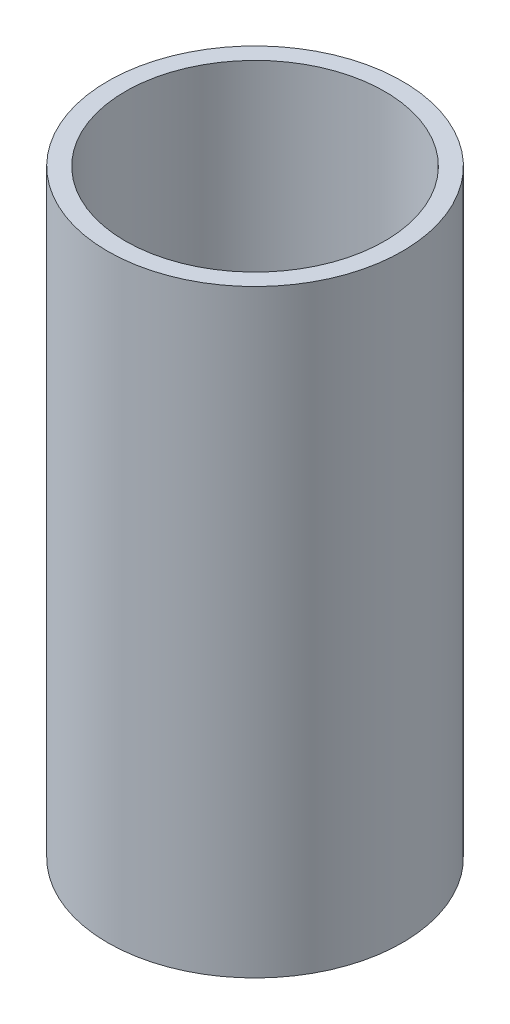
ISO-10303-21;
HEADER;
FILE_DESCRIPTION(('STEP AP214'),'2;1');
FILE_NAME('part.step','',(''),(''),'','','');
FILE_SCHEMA(('AUTOMOTIVE_DESIGN { 1 0 10303 214 1 1 1 1 }'));
ENDSEC;
DATA;
#1=APPLICATION_CONTEXT('core data for automotive mechanical design processes');
#2=APPLICATION_PROTOCOL_DEFINITION('international standard','automotive_design',2000,#1);
#3=PRODUCT_CONTEXT('',#1,'mechanical');
#4=PRODUCT('Part','Part','',(#3));
#5=PRODUCT_RELATED_PRODUCT_CATEGORY('part','',(#4));
#6=PRODUCT_DEFINITION_FORMATION('','',#4);
#7=PRODUCT_DEFINITION_CONTEXT('part definition',#1,'design');
#8=PRODUCT_DEFINITION('design','',#6,#7);
#9=PRODUCT_DEFINITION_SHAPE('','',#8);
#10=(LENGTH_UNIT() NAMED_UNIT(*) SI_UNIT(.MILLI.,.METRE.));
#11=(NAMED_UNIT(*) PLANE_ANGLE_UNIT() SI_UNIT($,.RADIAN.));
#12=(NAMED_UNIT(*) SI_UNIT($,.STERADIAN.) SOLID_ANGLE_UNIT());
#13=UNCERTAINTY_MEASURE_WITH_UNIT(LENGTH_MEASURE(1.E-05),#10,'distance_accuracy_value','');
#14=(GEOMETRIC_REPRESENTATION_CONTEXT(3) GLOBAL_UNCERTAINTY_ASSIGNED_CONTEXT((#13)) GLOBAL_UNIT_ASSIGNED_CONTEXT((#10,
#11,#12)) REPRESENTATION_CONTEXT('',''));
#15=CARTESIAN_POINT('',(0.,0.,0.));
#16=DIRECTION('',(0.,0.,1.));
#17=DIRECTION('',(1.,0.,0.));
#18=AXIS2_PLACEMENT_3D('',#15,#16,#17);
#19=CARTESIAN_POINT('',(0.,101.6,0.));
#20=DIRECTION('',(0.,1.,0.));
#21=DIRECTION('',(0.,0.,1.));
#22=AXIS2_PLACEMENT_3D('',#19,#20,#21);
#23=PLANE('',#22);
#24=CARTESIAN_POINT('',(0.,101.6,0.));
#25=DIRECTION('',(0.,1.,0.));
#26=DIRECTION('',(0.,0.,1.));
#27=AXIS2_PLACEMENT_3D('',#24,#25,#26);
#28=CIRCLE('',#27,25.);
#29=CARTESIAN_POINT('',(0.,101.6,25.));
#30=VERTEX_POINT('',#29);
#31=EDGE_CURVE('E10',#30,#30,#28,.T.);
#32=ORIENTED_EDGE('',*,*,#31,.T.);
#33=EDGE_LOOP('',(#32));
#34=FACE_BOUND('',#33,.T.);
#35=CARTESIAN_POINT('',(0.,101.6,0.));
#36=DIRECTION('',(0.,1.,0.));
#37=DIRECTION('',(0.,0.,1.));
#38=AXIS2_PLACEMENT_3D('',#35,#36,#37);
#39=CIRCLE('',#38,22.);
#40=CARTESIAN_POINT('',(0.,101.6,22.));
#41=VERTEX_POINT('',#40);
#42=EDGE_CURVE('E41',#41,#41,#39,.T.);
#43=ORIENTED_EDGE('',*,*,#42,.F.);
#44=EDGE_LOOP('',(#43));
#45=FACE_BOUND('',#44,.T.);
#46=ADVANCED_FACE('F30',(#34,#45),#23,.T.);
#47=CARTESIAN_POINT('',(0.,0.,0.));
#48=DIRECTION('',(0.,1.,0.));
#49=DIRECTION('',(0.,0.,1.));
#50=AXIS2_PLACEMENT_3D('',#47,#48,#49);
#51=PLANE('',#50);
#52=CARTESIAN_POINT('',(0.,0.,0.));
#53=DIRECTION('',(0.,1.,0.));
#54=DIRECTION('',(0.,0.,1.));
#55=AXIS2_PLACEMENT_3D('',#52,#53,#54);
#56=CIRCLE('',#55,25.);
#57=CARTESIAN_POINT('',(0.,0.,25.));
#58=VERTEX_POINT('',#57);
#59=EDGE_CURVE('E34',#58,#58,#56,.T.);
#60=ORIENTED_EDGE('',*,*,#59,.F.);
#61=EDGE_LOOP('',(#60));
#62=FACE_BOUND('',#61,.T.);
#63=CARTESIAN_POINT('',(0.,0.,0.));
#64=DIRECTION('',(0.,1.,0.));
#65=DIRECTION('',(0.,0.,1.));
#66=AXIS2_PLACEMENT_3D('',#63,#64,#65);
#67=CIRCLE('',#66,22.);
#68=CARTESIAN_POINT('',(0.,0.,22.));
#69=VERTEX_POINT('',#68);
#70=EDGE_CURVE('E43',#69,#69,#67,.T.);
#71=ORIENTED_EDGE('',*,*,#70,.T.);
#72=EDGE_LOOP('',(#71));
#73=FACE_BOUND('',#72,.T.);
#74=ADVANCED_FACE('F53',(#62,#73),#51,.F.);
#75=CARTESIAN_POINT('',(0.,101.6,0.));
#76=DIRECTION('',(0.,-1.,0.));
#77=DIRECTION('',(0.,0.,-1.));
#78=AXIS2_PLACEMENT_3D('',#75,#76,#77);
#79=CYLINDRICAL_SURFACE('',#78,25.);
#80=ORIENTED_EDGE('',*,*,#31,.F.);
#81=EDGE_LOOP('',(#80));
#82=FACE_BOUND('',#81,.T.);
#83=ORIENTED_EDGE('',*,*,#59,.T.);
#84=EDGE_LOOP('',(#83));
#85=FACE_BOUND('',#84,.T.);
#86=ADVANCED_FACE('F32',(#82,#85),#79,.T.);
#87=CARTESIAN_POINT('',(0.,101.6,0.));
#88=DIRECTION('',(0.,-1.,0.));
#89=DIRECTION('',(0.,0.,-1.));
#90=AXIS2_PLACEMENT_3D('',#87,#88,#89);
#91=CYLINDRICAL_SURFACE('',#90,22.);
#92=ORIENTED_EDGE('',*,*,#42,.T.);
#93=EDGE_LOOP('',(#92));
#94=FACE_BOUND('',#93,.T.);
#95=ORIENTED_EDGE('',*,*,#70,.F.);
#96=EDGE_LOOP('',(#95));
#97=FACE_BOUND('',#96,.T.);
#98=ADVANCED_FACE('F49',(#94,#97),#91,.F.);
#99=CLOSED_SHELL('',(#46,#74,#86,#98));
#100=MANIFOLD_SOLID_BREP('B2',#99);
#101=ADVANCED_BREP_SHAPE_REPRESENTATION('',(#18,#100),#14);
#102=SHAPE_DEFINITION_REPRESENTATION(#9,#101);
ENDSEC;
END-ISO-10303-21;
